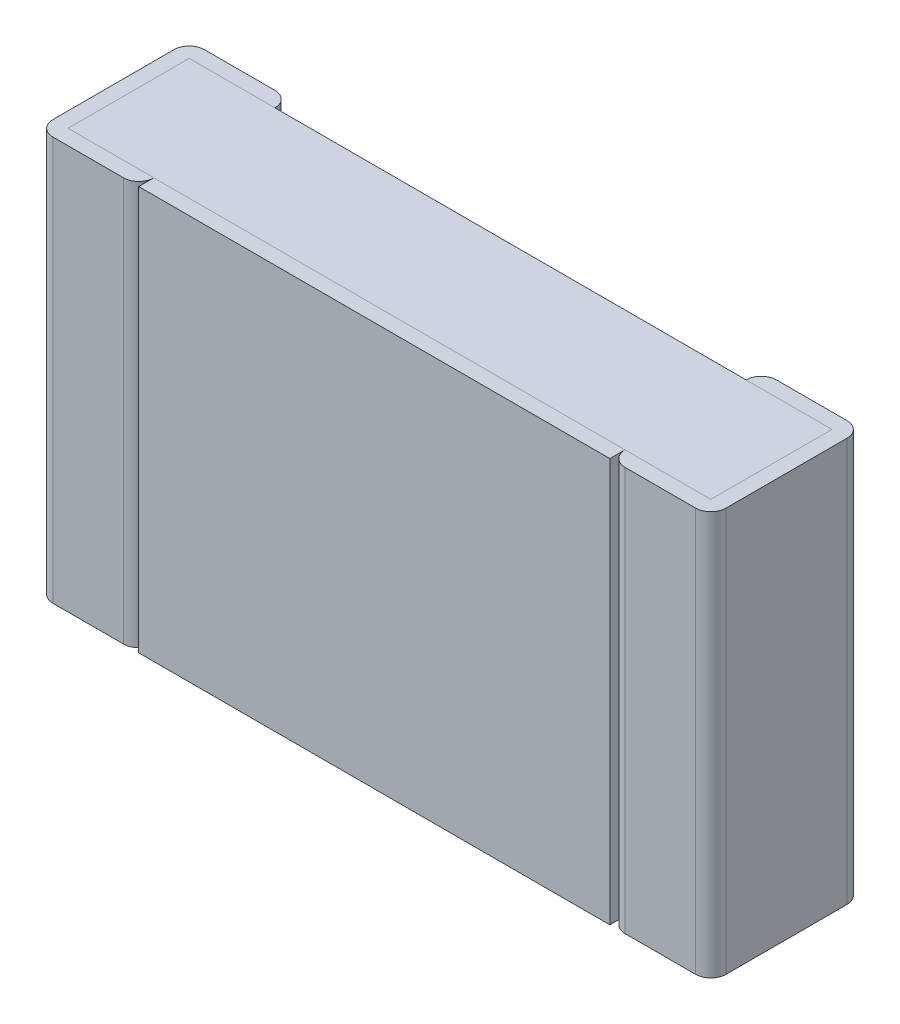
ISO-10303-21;
HEADER;
FILE_DESCRIPTION(('STEP AP214'),'2;1');
FILE_NAME('part.step','',(''),(''),'','','');
FILE_SCHEMA(('AUTOMOTIVE_DESIGN { 1 0 10303 214 1 1 1 1 }'));
ENDSEC;
DATA;
#1=APPLICATION_CONTEXT('core data for automotive mechanical design processes');
#2=APPLICATION_PROTOCOL_DEFINITION('international standard','automotive_design',2000,#1);
#3=PRODUCT_CONTEXT('',#1,'mechanical');
#4=PRODUCT('Part','Part','',(#3));
#5=PRODUCT_RELATED_PRODUCT_CATEGORY('part','',(#4));
#6=PRODUCT_DEFINITION_FORMATION('','',#4);
#7=PRODUCT_DEFINITION_CONTEXT('part definition',#1,'design');
#8=PRODUCT_DEFINITION('design','',#6,#7);
#9=PRODUCT_DEFINITION_SHAPE('','',#8);
#10=(LENGTH_UNIT() NAMED_UNIT(*) SI_UNIT(.MILLI.,.METRE.));
#11=(NAMED_UNIT(*) PLANE_ANGLE_UNIT() SI_UNIT($,.RADIAN.));
#12=(NAMED_UNIT(*) SI_UNIT($,.STERADIAN.) SOLID_ANGLE_UNIT());
#13=UNCERTAINTY_MEASURE_WITH_UNIT(LENGTH_MEASURE(1.E-05),#10,'distance_accuracy_value','');
#14=(GEOMETRIC_REPRESENTATION_CONTEXT(3) GLOBAL_UNCERTAINTY_ASSIGNED_CONTEXT((#13)) GLOBAL_UNIT_ASSIGNED_CONTEXT((#10,
#11,#12)) REPRESENTATION_CONTEXT('',''));
#15=CARTESIAN_POINT('',(0.,0.,0.));
#16=DIRECTION('',(0.,0.,1.));
#17=DIRECTION('',(1.,0.,0.));
#18=AXIS2_PLACEMENT_3D('',#15,#16,#17);
#19=CARTESIAN_POINT('',(-1.,-0.6,0.));
#20=DIRECTION('',(1.,0.,0.));
#21=DIRECTION('',(0.,1.,0.));
#22=AXIS2_PLACEMENT_3D('',#19,#20,#21);
#23=PLANE('',#22);
#24=DIRECTION('',(0.,1.,0.));
#25=VECTOR('',#24,1.);
#26=CARTESIAN_POINT('',(-1.,-0.6,0.405));
#27=LINE('',#26,#25);
#28=CARTESIAN_POINT('',(-1.,-0.6,0.405));
#29=VERTEX_POINT('',#28);
#30=CARTESIAN_POINT('',(-1.,0.6,0.405));
#31=VERTEX_POINT('',#30);
#32=EDGE_CURVE('E11',#29,#31,#27,.T.);
#33=ORIENTED_EDGE('',*,*,#32,.T.);
#34=DIRECTION('',(0.,0.,1.));
#35=VECTOR('',#34,1.);
#36=CARTESIAN_POINT('',(-1.,0.6,0.));
#37=LINE('',#36,#35);
#38=CARTESIAN_POINT('',(-1.,0.6,0.045));
#39=VERTEX_POINT('',#38);
#40=EDGE_CURVE('E41',#39,#31,#37,.T.);
#41=ORIENTED_EDGE('',*,*,#40,.F.);
#42=DIRECTION('',(0.,1.,0.));
#43=VECTOR('',#42,1.);
#44=CARTESIAN_POINT('',(-1.,-0.6,0.045));
#45=LINE('',#44,#43);
#46=CARTESIAN_POINT('',(-1.,-0.6,0.045));
#47=VERTEX_POINT('',#46);
#48=EDGE_CURVE('E317',#47,#39,#45,.T.);
#49=ORIENTED_EDGE('',*,*,#48,.F.);
#50=DIRECTION('',(0.,0.,1.));
#51=VECTOR('',#50,1.);
#52=CARTESIAN_POINT('',(-1.,-0.6,0.));
#53=LINE('',#52,#51);
#54=EDGE_CURVE('E27',#47,#29,#53,.T.);
#55=ORIENTED_EDGE('',*,*,#54,.T.);
#56=EDGE_LOOP('',(#33,#41,#49,#55));
#57=FACE_BOUND('',#56,.T.);
#58=ADVANCED_FACE('F16',(#57),#23,.F.);
#59=CARTESIAN_POINT('',(-1.,-0.6,0.));
#60=DIRECTION('',(0.,1.,0.));
#61=DIRECTION('',(1.,0.,0.));
#62=AXIS2_PLACEMENT_3D('',#59,#60,#61);
#63=PLANE('',#62);
#64=CARTESIAN_POINT('',(-0.745,-0.6,0.045));
#65=DIRECTION('',(0.,1.,0.));
#66=DIRECTION('',(0.,0.,1.));
#67=AXIS2_PLACEMENT_3D('',#64,#65,#66);
#68=CIRCLE('',#67,0.045);
#69=CARTESIAN_POINT('',(-0.7,-0.6,0.045));
#70=VERTEX_POINT('',#69);
#71=CARTESIAN_POINT('',(-0.745,-0.6,0.));
#72=VERTEX_POINT('',#71);
#73=EDGE_CURVE('E260',#70,#72,#68,.T.);
#74=ORIENTED_EDGE('',*,*,#73,.F.);
#75=DIRECTION('',(1.,0.,0.));
#76=VECTOR('',#75,1.);
#77=CARTESIAN_POINT('',(-0.955,-0.6,0.045));
#78=LINE('',#77,#76);
#79=CARTESIAN_POINT('',(-0.955,-0.6,0.045));
#80=VERTEX_POINT('',#79);
#81=EDGE_CURVE('E356',#80,#70,#78,.T.);
#82=ORIENTED_EDGE('',*,*,#81,.F.);
#83=DIRECTION('',(0.,0.,1.));
#84=VECTOR('',#83,1.);
#85=CARTESIAN_POINT('',(-0.955,-0.6,0.045));
#86=LINE('',#85,#84);
#87=CARTESIAN_POINT('',(-0.955,-0.6,0.405));
#88=VERTEX_POINT('',#87);
#89=EDGE_CURVE('E333',#80,#88,#86,.T.);
#90=ORIENTED_EDGE('',*,*,#89,.T.);
#91=DIRECTION('',(1.,0.,0.));
#92=VECTOR('',#91,1.);
#93=CARTESIAN_POINT('',(-0.955,-0.6,0.405));
#94=LINE('',#93,#92);
#95=CARTESIAN_POINT('',(-0.7,-0.6,0.405));
#96=VERTEX_POINT('',#95);
#97=EDGE_CURVE('E336',#88,#96,#94,.T.);
#98=ORIENTED_EDGE('',*,*,#97,.T.);
#99=CARTESIAN_POINT('',(-0.745,-0.6,0.405));
#100=DIRECTION('',(0.,-1.,0.));
#101=DIRECTION('',(0.,0.,1.));
#102=AXIS2_PLACEMENT_3D('',#99,#100,#101);
#103=CIRCLE('',#102,0.045);
#104=CARTESIAN_POINT('',(-0.745,-0.6,0.45));
#105=VERTEX_POINT('',#104);
#106=EDGE_CURVE('E344',#96,#105,#103,.T.);
#107=ORIENTED_EDGE('',*,*,#106,.T.);
#108=DIRECTION('',(1.,0.,0.));
#109=VECTOR('',#108,1.);
#110=CARTESIAN_POINT('',(-1.,-0.6,0.45));
#111=LINE('',#110,#109);
#112=CARTESIAN_POINT('',(-0.955,-0.6,0.45));
#113=VERTEX_POINT('',#112);
#114=EDGE_CURVE('E272',#113,#105,#111,.T.);
#115=ORIENTED_EDGE('',*,*,#114,.F.);
#116=CARTESIAN_POINT('',(-0.955,-0.6,0.405));
#117=DIRECTION('',(0.,1.,0.));
#118=DIRECTION('',(0.,0.,1.));
#119=AXIS2_PLACEMENT_3D('',#116,#117,#118);
#120=CIRCLE('',#119,0.045);
#121=EDGE_CURVE('E318',#29,#113,#120,.T.);
#122=ORIENTED_EDGE('',*,*,#121,.F.);
#123=ORIENTED_EDGE('',*,*,#54,.F.);
#124=CARTESIAN_POINT('',(-0.955,-0.6,0.045));
#125=DIRECTION('',(0.,-1.,0.));
#126=DIRECTION('',(0.,0.,1.));
#127=AXIS2_PLACEMENT_3D('',#124,#125,#126);
#128=CIRCLE('',#127,0.045);
#129=CARTESIAN_POINT('',(-0.955,-0.6,0.));
#130=VERTEX_POINT('',#129);
#131=EDGE_CURVE('E340',#47,#130,#128,.T.);
#132=ORIENTED_EDGE('',*,*,#131,.T.);
#133=DIRECTION('',(1.,0.,0.));
#134=VECTOR('',#133,1.);
#135=CARTESIAN_POINT('',(-1.,-0.6,0.));
#136=LINE('',#135,#134);
#137=EDGE_CURVE('E345',#130,#72,#136,.T.);
#138=ORIENTED_EDGE('',*,*,#137,.T.);
#139=EDGE_LOOP('',(#74,#82,#90,#98,#107,#115,#122,#123,#132,#138));
#140=FACE_BOUND('',#139,.T.);
#141=ADVANCED_FACE('F523',(#140),#63,.F.);
#142=CARTESIAN_POINT('',(-0.955,-0.6,0.045));
#143=DIRECTION('',(0.,1.,0.));
#144=DIRECTION('',(-1.,0.,0.));
#145=AXIS2_PLACEMENT_3D('',#142,#143,#144);
#146=CYLINDRICAL_SURFACE('',#145,0.045);
#147=ORIENTED_EDGE('',*,*,#48,.T.);
#148=CARTESIAN_POINT('',(-0.955,0.6,0.045));
#149=DIRECTION('',(0.,-1.,0.));
#150=DIRECTION('',(0.,0.,1.));
#151=AXIS2_PLACEMENT_3D('',#148,#149,#150);
#152=CIRCLE('',#151,0.045);
#153=CARTESIAN_POINT('',(-0.955,0.6,0.));
#154=VERTEX_POINT('',#153);
#155=EDGE_CURVE('E314',#39,#154,#152,.T.);
#156=ORIENTED_EDGE('',*,*,#155,.T.);
#157=DIRECTION('',(0.,1.,0.));
#158=VECTOR('',#157,1.);
#159=CARTESIAN_POINT('',(-0.955,-0.6,0.));
#160=LINE('',#159,#158);
#161=EDGE_CURVE('E311',#130,#154,#160,.T.);
#162=ORIENTED_EDGE('',*,*,#161,.F.);
#163=ORIENTED_EDGE('',*,*,#131,.F.);
#164=EDGE_LOOP('',(#147,#156,#162,#163));
#165=FACE_BOUND('',#164,.T.);
#166=ADVANCED_FACE('F552',(#165),#146,.T.);
#167=CARTESIAN_POINT('',(-0.955,-0.6,0.405));
#168=DIRECTION('',(0.,1.,0.));
#169=DIRECTION('',(-1.,0.,0.));
#170=AXIS2_PLACEMENT_3D('',#167,#168,#169);
#171=CYLINDRICAL_SURFACE('',#170,0.045);
#172=ORIENTED_EDGE('',*,*,#121,.T.);
#173=DIRECTION('',(0.,1.,0.));
#174=VECTOR('',#173,1.);
#175=CARTESIAN_POINT('',(-0.955,-0.6,0.45));
#176=LINE('',#175,#174);
#177=CARTESIAN_POINT('',(-0.955,0.6,0.45));
#178=VERTEX_POINT('',#177);
#179=EDGE_CURVE('E248',#113,#178,#176,.T.);
#180=ORIENTED_EDGE('',*,*,#179,.T.);
#181=CARTESIAN_POINT('',(-0.955,0.6,0.405));
#182=DIRECTION('',(0.,1.,0.));
#183=DIRECTION('',(0.,0.,1.));
#184=AXIS2_PLACEMENT_3D('',#181,#182,#183);
#185=CIRCLE('',#184,0.045);
#186=EDGE_CURVE('E267',#31,#178,#185,.T.);
#187=ORIENTED_EDGE('',*,*,#186,.F.);
#188=ORIENTED_EDGE('',*,*,#32,.F.);
#189=EDGE_LOOP('',(#172,#180,#187,#188));
#190=FACE_BOUND('',#189,.T.);
#191=ADVANCED_FACE('F548',(#190),#171,.T.);
#192=CARTESIAN_POINT('',(-1.,0.6,0.));
#193=DIRECTION('',(0.,1.,0.));
#194=DIRECTION('',(1.,0.,0.));
#195=AXIS2_PLACEMENT_3D('',#192,#193,#194);
#196=PLANE('',#195);
#197=DIRECTION('',(1.,0.,0.));
#198=VECTOR('',#197,1.);
#199=CARTESIAN_POINT('',(-1.,0.6,0.));
#200=LINE('',#199,#198);
#201=CARTESIAN_POINT('',(-0.745,0.6,0.));
#202=VERTEX_POINT('',#201);
#203=EDGE_CURVE('E263',#154,#202,#200,.T.);
#204=ORIENTED_EDGE('',*,*,#203,.F.);
#205=ORIENTED_EDGE('',*,*,#155,.F.);
#206=ORIENTED_EDGE('',*,*,#40,.T.);
#207=ORIENTED_EDGE('',*,*,#186,.T.);
#208=DIRECTION('',(1.,0.,0.));
#209=VECTOR('',#208,1.);
#210=CARTESIAN_POINT('',(-1.,0.6,0.45));
#211=LINE('',#210,#209);
#212=CARTESIAN_POINT('',(-0.745,0.6,0.45));
#213=VERTEX_POINT('',#212);
#214=EDGE_CURVE('E397',#178,#213,#211,.T.);
#215=ORIENTED_EDGE('',*,*,#214,.T.);
#216=CARTESIAN_POINT('',(-0.745,0.6,0.405));
#217=DIRECTION('',(0.,-1.,0.));
#218=DIRECTION('',(0.,0.,1.));
#219=AXIS2_PLACEMENT_3D('',#216,#217,#218);
#220=CIRCLE('',#219,0.045);
#221=CARTESIAN_POINT('',(-0.7,0.6,0.405));
#222=VERTEX_POINT('',#221);
#223=EDGE_CURVE('E291',#222,#213,#220,.T.);
#224=ORIENTED_EDGE('',*,*,#223,.F.);
#225=DIRECTION('',(1.,0.,0.));
#226=VECTOR('',#225,1.);
#227=CARTESIAN_POINT('',(-0.955,0.6,0.405));
#228=LINE('',#227,#226);
#229=CARTESIAN_POINT('',(-0.955,0.6,0.405));
#230=VERTEX_POINT('',#229);
#231=EDGE_CURVE('E368',#230,#222,#228,.T.);
#232=ORIENTED_EDGE('',*,*,#231,.F.);
#233=DIRECTION('',(0.,0.,1.));
#234=VECTOR('',#233,1.);
#235=CARTESIAN_POINT('',(-0.955,0.6,0.045));
#236=LINE('',#235,#234);
#237=CARTESIAN_POINT('',(-0.955,0.6,0.045));
#238=VERTEX_POINT('',#237);
#239=EDGE_CURVE('E294',#238,#230,#236,.T.);
#240=ORIENTED_EDGE('',*,*,#239,.F.);
#241=DIRECTION('',(1.,0.,0.));
#242=VECTOR('',#241,1.);
#243=CARTESIAN_POINT('',(-0.955,0.6,0.045));
#244=LINE('',#243,#242);
#245=CARTESIAN_POINT('',(-0.7,0.6,0.045));
#246=VERTEX_POINT('',#245);
#247=EDGE_CURVE('E310',#238,#246,#244,.T.);
#248=ORIENTED_EDGE('',*,*,#247,.T.);
#249=CARTESIAN_POINT('',(-0.745,0.6,0.045));
#250=DIRECTION('',(0.,1.,0.));
#251=DIRECTION('',(0.,0.,1.));
#252=AXIS2_PLACEMENT_3D('',#249,#250,#251);
#253=CIRCLE('',#252,0.045);
#254=EDGE_CURVE('E306',#246,#202,#253,.T.);
#255=ORIENTED_EDGE('',*,*,#254,.T.);
#256=EDGE_LOOP('',(#204,#205,#206,#207,#215,#224,#232,#240,#248,#255));
#257=FACE_BOUND('',#256,.T.);
#258=ADVANCED_FACE('F489',(#257),#196,.T.);
#259=CARTESIAN_POINT('',(-1.,-0.6,0.));
#260=DIRECTION('',(0.,0.,1.));
#261=DIRECTION('',(1.,0.,0.));
#262=AXIS2_PLACEMENT_3D('',#259,#260,#261);
#263=PLANE('',#262);
#264=DIRECTION('',(0.,1.,0.));
#265=VECTOR('',#264,1.);
#266=CARTESIAN_POINT('',(-0.745,-0.6,0.));
#267=LINE('',#266,#265);
#268=EDGE_CURVE('E264',#72,#202,#267,.T.);
#269=ORIENTED_EDGE('',*,*,#268,.F.);
#270=ORIENTED_EDGE('',*,*,#137,.F.);
#271=ORIENTED_EDGE('',*,*,#161,.T.);
#272=ORIENTED_EDGE('',*,*,#203,.T.);
#273=EDGE_LOOP('',(#269,#270,#271,#272));
#274=FACE_BOUND('',#273,.T.);
#275=ADVANCED_FACE('F678',(#274),#263,.F.);
#276=CARTESIAN_POINT('',(-0.745,-0.6,0.045));
#277=DIRECTION('',(0.,1.,0.));
#278=DIRECTION('',(1.,0.,0.));
#279=AXIS2_PLACEMENT_3D('',#276,#277,#278);
#280=CYLINDRICAL_SURFACE('',#279,0.045);
#281=ORIENTED_EDGE('',*,*,#73,.T.);
#282=ORIENTED_EDGE('',*,*,#268,.T.);
#283=ORIENTED_EDGE('',*,*,#254,.F.);
#284=DIRECTION('',(0.,1.,0.));
#285=VECTOR('',#284,1.);
#286=CARTESIAN_POINT('',(-0.7,-0.6,0.045));
#287=LINE('',#286,#285);
#288=EDGE_CURVE('E299',#70,#246,#287,.T.);
#289=ORIENTED_EDGE('',*,*,#288,.F.);
#290=EDGE_LOOP('',(#281,#282,#283,#289));
#291=FACE_BOUND('',#290,.T.);
#292=ADVANCED_FACE('F682',(#291),#280,.T.);
#293=CARTESIAN_POINT('',(-0.955,-0.6,0.045));
#294=DIRECTION('',(0.,1.,0.));
#295=DIRECTION('',(1.,0.,0.));
#296=AXIS2_PLACEMENT_3D('',#293,#294,#295);
#297=PLANE('',#296);
#298=DIRECTION('',(1.,0.,0.));
#299=VECTOR('',#298,1.);
#300=CARTESIAN_POINT('',(-0.955,-0.6,0.045));
#301=LINE('',#300,#299);
#302=CARTESIAN_POINT('',(0.7,-0.6,0.045));
#303=VERTEX_POINT('',#302);
#304=EDGE_CURVE('E346',#70,#303,#301,.T.);
#305=ORIENTED_EDGE('',*,*,#304,.T.);
#306=DIRECTION('',(1.,0.,0.));
#307=VECTOR('',#306,1.);
#308=CARTESIAN_POINT('',(-0.955,-0.6,0.045));
#309=LINE('',#308,#307);
#310=CARTESIAN_POINT('',(0.955,-0.6,0.045));
#311=VERTEX_POINT('',#310);
#312=EDGE_CURVE('E350',#303,#311,#309,.T.);
#313=ORIENTED_EDGE('',*,*,#312,.T.);
#314=DIRECTION('',(0.,0.,1.));
#315=VECTOR('',#314,1.);
#316=CARTESIAN_POINT('',(0.955,-0.6,0.045));
#317=LINE('',#316,#315);
#318=CARTESIAN_POINT('',(0.955,-0.6,0.405));
#319=VERTEX_POINT('',#318);
#320=EDGE_CURVE('E382',#311,#319,#317,.T.);
#321=ORIENTED_EDGE('',*,*,#320,.T.);
#322=DIRECTION('',(1.,0.,0.));
#323=VECTOR('',#322,1.);
#324=CARTESIAN_POINT('',(-0.955,-0.6,0.405));
#325=LINE('',#324,#323);
#326=CARTESIAN_POINT('',(0.7,-0.6,0.405));
#327=VERTEX_POINT('',#326);
#328=EDGE_CURVE('E421',#327,#319,#325,.T.);
#329=ORIENTED_EDGE('',*,*,#328,.F.);
#330=DIRECTION('',(1.,0.,0.));
#331=VECTOR('',#330,1.);
#332=CARTESIAN_POINT('',(-0.7,-0.6,0.405));
#333=LINE('',#332,#331);
#334=EDGE_CURVE('E301',#96,#327,#333,.T.);
#335=ORIENTED_EDGE('',*,*,#334,.F.);
#336=ORIENTED_EDGE('',*,*,#97,.F.);
#337=ORIENTED_EDGE('',*,*,#89,.F.);
#338=ORIENTED_EDGE('',*,*,#81,.T.);
#339=EDGE_LOOP('',(#305,#313,#321,#329,#335,#336,#337,#338));
#340=FACE_BOUND('',#339,.T.);
#341=ADVANCED_FACE('F483',(#340),#297,.F.);
#342=CARTESIAN_POINT('',(-1.,-0.6,0.45));
#343=DIRECTION('',(0.,0.,1.));
#344=DIRECTION('',(1.,0.,0.));
#345=AXIS2_PLACEMENT_3D('',#342,#343,#344);
#346=PLANE('',#345);
#347=ORIENTED_EDGE('',*,*,#214,.F.);
#348=ORIENTED_EDGE('',*,*,#179,.F.);
#349=ORIENTED_EDGE('',*,*,#114,.T.);
#350=DIRECTION('',(0.,1.,0.));
#351=VECTOR('',#350,1.);
#352=CARTESIAN_POINT('',(-0.745,-0.6,0.45));
#353=LINE('',#352,#351);
#354=EDGE_CURVE('E268',#105,#213,#353,.T.);
#355=ORIENTED_EDGE('',*,*,#354,.T.);
#356=EDGE_LOOP('',(#347,#348,#349,#355));
#357=FACE_BOUND('',#356,.T.);
#358=ADVANCED_FACE('F579',(#357),#346,.T.);
#359=CARTESIAN_POINT('',(-0.745,-0.6,0.405));
#360=DIRECTION('',(0.,1.,0.));
#361=DIRECTION('',(1.,0.,0.));
#362=AXIS2_PLACEMENT_3D('',#359,#360,#361);
#363=CYLINDRICAL_SURFACE('',#362,0.045);
#364=DIRECTION('',(0.,1.,0.));
#365=VECTOR('',#364,1.);
#366=CARTESIAN_POINT('',(-0.7,-0.6,0.405));
#367=LINE('',#366,#365);
#368=EDGE_CURVE('E273',#96,#222,#367,.T.);
#369=ORIENTED_EDGE('',*,*,#368,.T.);
#370=ORIENTED_EDGE('',*,*,#223,.T.);
#371=ORIENTED_EDGE('',*,*,#354,.F.);
#372=ORIENTED_EDGE('',*,*,#106,.F.);
#373=EDGE_LOOP('',(#369,#370,#371,#372));
#374=FACE_BOUND('',#373,.T.);
#375=ADVANCED_FACE('F575',(#374),#363,.T.);
#376=CARTESIAN_POINT('',(-0.955,0.6,0.045));
#377=DIRECTION('',(0.,1.,0.));
#378=DIRECTION('',(1.,0.,0.));
#379=AXIS2_PLACEMENT_3D('',#376,#377,#378);
#380=PLANE('',#379);
#381=ORIENTED_EDGE('',*,*,#247,.F.);
#382=ORIENTED_EDGE('',*,*,#239,.T.);
#383=ORIENTED_EDGE('',*,*,#231,.T.);
#384=DIRECTION('',(1.,0.,0.));
#385=VECTOR('',#384,1.);
#386=CARTESIAN_POINT('',(-0.7,0.6,0.405));
#387=LINE('',#386,#385);
#388=CARTESIAN_POINT('',(0.7,0.6,0.405));
#389=VERTEX_POINT('',#388);
#390=EDGE_CURVE('E322',#222,#389,#387,.T.);
#391=ORIENTED_EDGE('',*,*,#390,.T.);
#392=DIRECTION('',(1.,0.,0.));
#393=VECTOR('',#392,1.);
#394=CARTESIAN_POINT('',(-0.955,0.6,0.405));
#395=LINE('',#394,#393);
#396=CARTESIAN_POINT('',(0.955,0.6,0.405));
#397=VERTEX_POINT('',#396);
#398=EDGE_CURVE('E228',#389,#397,#395,.T.);
#399=ORIENTED_EDGE('',*,*,#398,.T.);
#400=DIRECTION('',(0.,0.,1.));
#401=VECTOR('',#400,1.);
#402=CARTESIAN_POINT('',(0.955,0.6,0.045));
#403=LINE('',#402,#401);
#404=CARTESIAN_POINT('',(0.955,0.6,0.045));
#405=VERTEX_POINT('',#404);
#406=EDGE_CURVE('E219',#405,#397,#403,.T.);
#407=ORIENTED_EDGE('',*,*,#406,.F.);
#408=DIRECTION('',(1.,0.,0.));
#409=VECTOR('',#408,1.);
#410=CARTESIAN_POINT('',(-0.955,0.6,0.045));
#411=LINE('',#410,#409);
#412=CARTESIAN_POINT('',(0.7,0.6,0.045));
#413=VERTEX_POINT('',#412);
#414=EDGE_CURVE('E224',#413,#405,#411,.T.);
#415=ORIENTED_EDGE('',*,*,#414,.F.);
#416=DIRECTION('',(1.,0.,0.));
#417=VECTOR('',#416,1.);
#418=CARTESIAN_POINT('',(-0.955,0.6,0.045));
#419=LINE('',#418,#417);
#420=EDGE_CURVE('E323',#246,#413,#419,.T.);
#421=ORIENTED_EDGE('',*,*,#420,.F.);
#422=EDGE_LOOP('',(#381,#382,#383,#391,#399,#407,#415,#421));
#423=FACE_BOUND('',#422,.T.);
#424=ADVANCED_FACE('F222',(#423),#380,.T.);
#425=CARTESIAN_POINT('',(-0.955,-0.6,0.045));
#426=DIRECTION('',(0.,0.,1.));
#427=DIRECTION('',(1.,0.,0.));
#428=AXIS2_PLACEMENT_3D('',#425,#426,#427);
#429=PLANE('',#428);
#430=ORIENTED_EDGE('',*,*,#420,.T.);
#431=DIRECTION('',(0.,1.,0.));
#432=VECTOR('',#431,1.);
#433=CARTESIAN_POINT('',(0.7,-0.6,0.045));
#434=LINE('',#433,#432);
#435=EDGE_CURVE('E282',#303,#413,#434,.T.);
#436=ORIENTED_EDGE('',*,*,#435,.F.);
#437=ORIENTED_EDGE('',*,*,#304,.F.);
#438=ORIENTED_EDGE('',*,*,#288,.T.);
#439=EDGE_LOOP('',(#430,#436,#437,#438));
#440=FACE_BOUND('',#439,.T.);
#441=ADVANCED_FACE('F486',(#440),#429,.F.);
#442=CARTESIAN_POINT('',(0.7,-0.6,0.));
#443=DIRECTION('',(0.,1.,0.));
#444=DIRECTION('',(1.,0.,0.));
#445=AXIS2_PLACEMENT_3D('',#442,#443,#444);
#446=PLANE('',#445);
#447=CARTESIAN_POINT('',(0.955,-0.6,0.045));
#448=DIRECTION('',(0.,1.,0.));
#449=DIRECTION('',(0.,0.,1.));
#450=AXIS2_PLACEMENT_3D('',#447,#448,#449);
#451=CIRCLE('',#450,0.045);
#452=CARTESIAN_POINT('',(1.,-0.6,0.045));
#453=VERTEX_POINT('',#452);
#454=CARTESIAN_POINT('',(0.955,-0.6,0.));
#455=VERTEX_POINT('',#454);
#456=EDGE_CURVE('E283',#453,#455,#451,.T.);
#457=ORIENTED_EDGE('',*,*,#456,.F.);
#458=DIRECTION('',(0.,0.,1.));
#459=VECTOR('',#458,1.);
#460=CARTESIAN_POINT('',(1.,-0.6,0.));
#461=LINE('',#460,#459);
#462=CARTESIAN_POINT('',(1.,-0.6,0.405));
#463=VERTEX_POINT('',#462);
#464=EDGE_CURVE('E295',#453,#463,#461,.T.);
#465=ORIENTED_EDGE('',*,*,#464,.T.);
#466=CARTESIAN_POINT('',(0.955,-0.6,0.405));
#467=DIRECTION('',(0.,-1.,0.));
#468=DIRECTION('',(0.,0.,1.));
#469=AXIS2_PLACEMENT_3D('',#466,#467,#468);
#470=CIRCLE('',#469,0.045);
#471=CARTESIAN_POINT('',(0.955,-0.6,0.45));
#472=VERTEX_POINT('',#471);
#473=EDGE_CURVE('E300',#463,#472,#470,.T.);
#474=ORIENTED_EDGE('',*,*,#473,.T.);
#475=DIRECTION('',(1.,0.,0.));
#476=VECTOR('',#475,1.);
#477=CARTESIAN_POINT('',(0.7,-0.6,0.45));
#478=LINE('',#477,#476);
#479=CARTESIAN_POINT('',(0.745,-0.6,0.45));
#480=VERTEX_POINT('',#479);
#481=EDGE_CURVE('E259',#480,#472,#478,.T.);
#482=ORIENTED_EDGE('',*,*,#481,.F.);
#483=CARTESIAN_POINT('',(0.745,-0.6,0.405));
#484=DIRECTION('',(0.,1.,0.));
#485=DIRECTION('',(0.,0.,1.));
#486=AXIS2_PLACEMENT_3D('',#483,#484,#485);
#487=CIRCLE('',#486,0.045);
#488=EDGE_CURVE('E364',#327,#480,#487,.T.);
#489=ORIENTED_EDGE('',*,*,#488,.F.);
#490=ORIENTED_EDGE('',*,*,#328,.T.);
#491=ORIENTED_EDGE('',*,*,#320,.F.);
#492=ORIENTED_EDGE('',*,*,#312,.F.);
#493=CARTESIAN_POINT('',(0.745,-0.6,0.045));
#494=DIRECTION('',(0.,-1.,0.));
#495=DIRECTION('',(0.,0.,1.));
#496=AXIS2_PLACEMENT_3D('',#493,#494,#495);
#497=CIRCLE('',#496,0.045);
#498=CARTESIAN_POINT('',(0.745,-0.6,0.));
#499=VERTEX_POINT('',#498);
#500=EDGE_CURVE('E433',#303,#499,#497,.T.);
#501=ORIENTED_EDGE('',*,*,#500,.T.);
#502=DIRECTION('',(1.,0.,0.));
#503=VECTOR('',#502,1.);
#504=CARTESIAN_POINT('',(0.7,-0.6,0.));
#505=LINE('',#504,#503);
#506=EDGE_CURVE('E326',#499,#455,#505,.T.);
#507=ORIENTED_EDGE('',*,*,#506,.T.);
#508=EDGE_LOOP('',(#457,#465,#474,#482,#489,#490,#491,#492,#501,#507));
#509=FACE_BOUND('',#508,.T.);
#510=ADVANCED_FACE('F479',(#509),#446,.F.);
#511=CARTESIAN_POINT('',(-0.7,-0.6,0.405));
#512=DIRECTION('',(0.,1.,0.));
#513=DIRECTION('',(1.,0.,0.));
#514=AXIS2_PLACEMENT_3D('',#511,#512,#513);
#515=PLANE('',#514);
#516=DIRECTION('',(0.,0.,1.));
#517=VECTOR('',#516,1.);
#518=CARTESIAN_POINT('',(0.7,-0.6,0.405));
#519=LINE('',#518,#517);
#520=CARTESIAN_POINT('',(0.7,-0.6,0.45));
#521=VERTEX_POINT('',#520);
#522=EDGE_CURVE('E305',#327,#521,#519,.T.);
#523=ORIENTED_EDGE('',*,*,#522,.T.);
#524=DIRECTION('',(1.,0.,0.));
#525=VECTOR('',#524,1.);
#526=CARTESIAN_POINT('',(-0.7,-0.6,0.45));
#527=LINE('',#526,#525);
#528=CARTESIAN_POINT('',(-0.7,-0.6,0.45));
#529=VERTEX_POINT('',#528);
#530=EDGE_CURVE('E180',#529,#521,#527,.T.);
#531=ORIENTED_EDGE('',*,*,#530,.F.);
#532=DIRECTION('',(0.,0.,1.));
#533=VECTOR('',#532,1.);
#534=CARTESIAN_POINT('',(-0.7,-0.6,0.405));
#535=LINE('',#534,#533);
#536=EDGE_CURVE('E238',#96,#529,#535,.T.);
#537=ORIENTED_EDGE('',*,*,#536,.F.);
#538=ORIENTED_EDGE('',*,*,#334,.T.);
#539=EDGE_LOOP('',(#523,#531,#537,#538));
#540=FACE_BOUND('',#539,.T.);
#541=ADVANCED_FACE('F18',(#540),#515,.F.);
#542=CARTESIAN_POINT('',(-0.7,-0.6,0.405));
#543=DIRECTION('',(1.,0.,0.));
#544=DIRECTION('',(0.,1.,0.));
#545=AXIS2_PLACEMENT_3D('',#542,#543,#544);
#546=PLANE('',#545);
#547=DIRECTION('',(0.,1.,0.));
#548=VECTOR('',#547,1.);
#549=CARTESIAN_POINT('',(-0.7,-0.6,0.45));
#550=LINE('',#549,#548);
#551=CARTESIAN_POINT('',(-0.7,0.6,0.45));
#552=VERTEX_POINT('',#551);
#553=EDGE_CURVE('E244',#529,#552,#550,.T.);
#554=ORIENTED_EDGE('',*,*,#553,.T.);
#555=DIRECTION('',(0.,0.,1.));
#556=VECTOR('',#555,1.);
#557=CARTESIAN_POINT('',(-0.7,0.6,0.405));
#558=LINE('',#557,#556);
#559=EDGE_CURVE('E20',#222,#552,#558,.T.);
#560=ORIENTED_EDGE('',*,*,#559,.F.);
#561=ORIENTED_EDGE('',*,*,#368,.F.);
#562=ORIENTED_EDGE('',*,*,#536,.T.);
#563=EDGE_LOOP('',(#554,#560,#561,#562));
#564=FACE_BOUND('',#563,.T.);
#565=ADVANCED_FACE('F528',(#564),#546,.F.);
#566=CARTESIAN_POINT('',(0.7,0.6,0.));
#567=DIRECTION('',(0.,1.,0.));
#568=DIRECTION('',(1.,0.,0.));
#569=AXIS2_PLACEMENT_3D('',#566,#567,#568);
#570=PLANE('',#569);
#571=DIRECTION('',(1.,0.,0.));
#572=VECTOR('',#571,1.);
#573=CARTESIAN_POINT('',(0.7,0.6,0.));
#574=LINE('',#573,#572);
#575=CARTESIAN_POINT('',(0.745,0.6,0.));
#576=VERTEX_POINT('',#575);
#577=CARTESIAN_POINT('',(0.955,0.6,0.));
#578=VERTEX_POINT('',#577);
#579=EDGE_CURVE('E286',#576,#578,#574,.T.);
#580=ORIENTED_EDGE('',*,*,#579,.F.);
#581=CARTESIAN_POINT('',(0.745,0.6,0.045));
#582=DIRECTION('',(0.,-1.,0.));
#583=DIRECTION('',(0.,0.,1.));
#584=AXIS2_PLACEMENT_3D('',#581,#582,#583);
#585=CIRCLE('',#584,0.045);
#586=EDGE_CURVE('E236',#413,#576,#585,.T.);
#587=ORIENTED_EDGE('',*,*,#586,.F.);
#588=ORIENTED_EDGE('',*,*,#414,.T.);
#589=ORIENTED_EDGE('',*,*,#406,.T.);
#590=ORIENTED_EDGE('',*,*,#398,.F.);
#591=CARTESIAN_POINT('',(0.745,0.6,0.405));
#592=DIRECTION('',(0.,1.,0.));
#593=DIRECTION('',(0.,0.,1.));
#594=AXIS2_PLACEMENT_3D('',#591,#592,#593);
#595=CIRCLE('',#594,0.045);
#596=CARTESIAN_POINT('',(0.745,0.6,0.45));
#597=VERTEX_POINT('',#596);
#598=EDGE_CURVE('E231',#389,#597,#595,.T.);
#599=ORIENTED_EDGE('',*,*,#598,.T.);
#600=DIRECTION('',(1.,0.,0.));
#601=VECTOR('',#600,1.);
#602=CARTESIAN_POINT('',(0.7,0.6,0.45));
#603=LINE('',#602,#601);
#604=CARTESIAN_POINT('',(0.955,0.6,0.45));
#605=VERTEX_POINT('',#604);
#606=EDGE_CURVE('E250',#597,#605,#603,.T.);
#607=ORIENTED_EDGE('',*,*,#606,.T.);
#608=CARTESIAN_POINT('',(0.955,0.6,0.405));
#609=DIRECTION('',(0.,-1.,0.));
#610=DIRECTION('',(0.,0.,1.));
#611=AXIS2_PLACEMENT_3D('',#608,#609,#610);
#612=CIRCLE('',#611,0.045);
#613=CARTESIAN_POINT('',(1.,0.6,0.405));
#614=VERTEX_POINT('',#613);
#615=EDGE_CURVE('E254',#614,#605,#612,.T.);
#616=ORIENTED_EDGE('',*,*,#615,.F.);
#617=DIRECTION('',(0.,0.,1.));
#618=VECTOR('',#617,1.);
#619=CARTESIAN_POINT('',(1.,0.6,0.));
#620=LINE('',#619,#618);
#621=CARTESIAN_POINT('',(1.,0.6,0.045));
#622=VERTEX_POINT('',#621);
#623=EDGE_CURVE('E363',#622,#614,#620,.T.);
#624=ORIENTED_EDGE('',*,*,#623,.F.);
#625=CARTESIAN_POINT('',(0.955,0.6,0.045));
#626=DIRECTION('',(0.,1.,0.));
#627=DIRECTION('',(0.,0.,1.));
#628=AXIS2_PLACEMENT_3D('',#625,#626,#627);
#629=CIRCLE('',#628,0.045);
#630=EDGE_CURVE('E253',#622,#578,#629,.T.);
#631=ORIENTED_EDGE('',*,*,#630,.T.);
#632=EDGE_LOOP('',(#580,#587,#588,#589,#590,#599,#607,#616,#624,#631));
#633=FACE_BOUND('',#632,.T.);
#634=ADVANCED_FACE('F234',(#633),#570,.T.);
#635=CARTESIAN_POINT('',(-0.7,0.6,0.405));
#636=DIRECTION('',(0.,1.,0.));
#637=DIRECTION('',(1.,0.,0.));
#638=AXIS2_PLACEMENT_3D('',#635,#636,#637);
#639=PLANE('',#638);
#640=ORIENTED_EDGE('',*,*,#390,.F.);
#641=ORIENTED_EDGE('',*,*,#559,.T.);
#642=DIRECTION('',(1.,0.,0.));
#643=VECTOR('',#642,1.);
#644=CARTESIAN_POINT('',(-0.7,0.6,0.45));
#645=LINE('',#644,#643);
#646=CARTESIAN_POINT('',(0.7,0.6,0.45));
#647=VERTEX_POINT('',#646);
#648=EDGE_CURVE('E278',#552,#647,#645,.T.);
#649=ORIENTED_EDGE('',*,*,#648,.T.);
#650=DIRECTION('',(0.,0.,1.));
#651=VECTOR('',#650,1.);
#652=CARTESIAN_POINT('',(0.7,0.6,0.405));
#653=LINE('',#652,#651);
#654=EDGE_CURVE('E274',#389,#647,#653,.T.);
#655=ORIENTED_EDGE('',*,*,#654,.F.);
#656=EDGE_LOOP('',(#640,#641,#649,#655));
#657=FACE_BOUND('',#656,.T.);
#658=ADVANCED_FACE('F532',(#657),#639,.T.);
#659=CARTESIAN_POINT('',(0.745,-0.6,0.045));
#660=DIRECTION('',(0.,1.,0.));
#661=DIRECTION('',(-1.,0.,0.));
#662=AXIS2_PLACEMENT_3D('',#659,#660,#661);
#663=CYLINDRICAL_SURFACE('',#662,0.045);
#664=ORIENTED_EDGE('',*,*,#435,.T.);
#665=ORIENTED_EDGE('',*,*,#586,.T.);
#666=DIRECTION('',(0.,1.,0.));
#667=VECTOR('',#666,1.);
#668=CARTESIAN_POINT('',(0.745,-0.6,0.));
#669=LINE('',#668,#667);
#670=EDGE_CURVE('E374',#499,#576,#669,.T.);
#671=ORIENTED_EDGE('',*,*,#670,.F.);
#672=ORIENTED_EDGE('',*,*,#500,.F.);
#673=EDGE_LOOP('',(#664,#665,#671,#672));
#674=FACE_BOUND('',#673,.T.);
#675=ADVANCED_FACE('F471',(#674),#663,.T.);
#676=CARTESIAN_POINT('',(0.7,-0.6,0.));
#677=DIRECTION('',(0.,0.,1.));
#678=DIRECTION('',(1.,0.,0.));
#679=AXIS2_PLACEMENT_3D('',#676,#677,#678);
#680=PLANE('',#679);
#681=DIRECTION('',(0.,1.,0.));
#682=VECTOR('',#681,1.);
#683=CARTESIAN_POINT('',(0.955,-0.6,0.));
#684=LINE('',#683,#682);
#685=EDGE_CURVE('E287',#455,#578,#684,.T.);
#686=ORIENTED_EDGE('',*,*,#685,.F.);
#687=ORIENTED_EDGE('',*,*,#506,.F.);
#688=ORIENTED_EDGE('',*,*,#670,.T.);
#689=ORIENTED_EDGE('',*,*,#579,.T.);
#690=EDGE_LOOP('',(#686,#687,#688,#689));
#691=FACE_BOUND('',#690,.T.);
#692=ADVANCED_FACE('F475',(#691),#680,.F.);
#693=CARTESIAN_POINT('',(0.955,-0.6,0.045));
#694=DIRECTION('',(0.,1.,0.));
#695=DIRECTION('',(1.,0.,0.));
#696=AXIS2_PLACEMENT_3D('',#693,#694,#695);
#697=CYLINDRICAL_SURFACE('',#696,0.045);
#698=ORIENTED_EDGE('',*,*,#456,.T.);
#699=ORIENTED_EDGE('',*,*,#685,.T.);
#700=ORIENTED_EDGE('',*,*,#630,.F.);
#701=DIRECTION('',(0.,1.,0.));
#702=VECTOR('',#701,1.);
#703=CARTESIAN_POINT('',(1.,-0.6,0.045));
#704=LINE('',#703,#702);
#705=EDGE_CURVE('E400',#453,#622,#704,.T.);
#706=ORIENTED_EDGE('',*,*,#705,.F.);
#707=EDGE_LOOP('',(#698,#699,#700,#706));
#708=FACE_BOUND('',#707,.T.);
#709=ADVANCED_FACE('F515',(#708),#697,.T.);
#710=CARTESIAN_POINT('',(1.,-0.6,0.));
#711=DIRECTION('',(1.,0.,0.));
#712=DIRECTION('',(0.,1.,0.));
#713=AXIS2_PLACEMENT_3D('',#710,#711,#712);
#714=PLANE('',#713);
#715=ORIENTED_EDGE('',*,*,#464,.F.);
#716=ORIENTED_EDGE('',*,*,#705,.T.);
#717=ORIENTED_EDGE('',*,*,#623,.T.);
#718=DIRECTION('',(0.,1.,0.));
#719=VECTOR('',#718,1.);
#720=CARTESIAN_POINT('',(1.,-0.6,0.405));
#721=LINE('',#720,#719);
#722=EDGE_CURVE('E258',#463,#614,#721,.T.);
#723=ORIENTED_EDGE('',*,*,#722,.F.);
#724=EDGE_LOOP('',(#715,#716,#717,#723));
#725=FACE_BOUND('',#724,.T.);
#726=ADVANCED_FACE('F511',(#725),#714,.T.);
#727=CARTESIAN_POINT('',(0.955,-0.6,0.405));
#728=DIRECTION('',(0.,1.,0.));
#729=DIRECTION('',(1.,0.,0.));
#730=AXIS2_PLACEMENT_3D('',#727,#728,#729);
#731=CYLINDRICAL_SURFACE('',#730,0.045);
#732=ORIENTED_EDGE('',*,*,#722,.T.);
#733=ORIENTED_EDGE('',*,*,#615,.T.);
#734=DIRECTION('',(0.,1.,0.));
#735=VECTOR('',#734,1.);
#736=CARTESIAN_POINT('',(0.955,-0.6,0.45));
#737=LINE('',#736,#735);
#738=EDGE_CURVE('E367',#472,#605,#737,.T.);
#739=ORIENTED_EDGE('',*,*,#738,.F.);
#740=ORIENTED_EDGE('',*,*,#473,.F.);
#741=EDGE_LOOP('',(#732,#733,#739,#740));
#742=FACE_BOUND('',#741,.T.);
#743=ADVANCED_FACE('F507',(#742),#731,.T.);
#744=CARTESIAN_POINT('',(0.7,-0.6,0.45));
#745=DIRECTION('',(0.,0.,1.));
#746=DIRECTION('',(1.,0.,0.));
#747=AXIS2_PLACEMENT_3D('',#744,#745,#746);
#748=PLANE('',#747);
#749=ORIENTED_EDGE('',*,*,#606,.F.);
#750=DIRECTION('',(0.,1.,0.));
#751=VECTOR('',#750,1.);
#752=CARTESIAN_POINT('',(0.745,-0.6,0.45));
#753=LINE('',#752,#751);
#754=EDGE_CURVE('E330',#480,#597,#753,.T.);
#755=ORIENTED_EDGE('',*,*,#754,.F.);
#756=ORIENTED_EDGE('',*,*,#481,.T.);
#757=ORIENTED_EDGE('',*,*,#738,.T.);
#758=EDGE_LOOP('',(#749,#755,#756,#757));
#759=FACE_BOUND('',#758,.T.);
#760=ADVANCED_FACE('F505',(#759),#748,.T.);
#761=CARTESIAN_POINT('',(0.745,-0.6,0.405));
#762=DIRECTION('',(0.,1.,0.));
#763=DIRECTION('',(-1.,0.,0.));
#764=AXIS2_PLACEMENT_3D('',#761,#762,#763);
#765=CYLINDRICAL_SURFACE('',#764,0.045);
#766=ORIENTED_EDGE('',*,*,#488,.T.);
#767=ORIENTED_EDGE('',*,*,#754,.T.);
#768=ORIENTED_EDGE('',*,*,#598,.F.);
#769=DIRECTION('',(0.,1.,0.));
#770=VECTOR('',#769,1.);
#771=CARTESIAN_POINT('',(0.7,-0.6,0.405));
#772=LINE('',#771,#770);
#773=EDGE_CURVE('E277',#327,#389,#772,.T.);
#774=ORIENTED_EDGE('',*,*,#773,.F.);
#775=EDGE_LOOP('',(#766,#767,#768,#774));
#776=FACE_BOUND('',#775,.T.);
#777=ADVANCED_FACE('F500',(#776),#765,.T.);
#778=CARTESIAN_POINT('',(0.7,-0.6,0.405));
#779=DIRECTION('',(1.,0.,0.));
#780=DIRECTION('',(0.,1.,0.));
#781=AXIS2_PLACEMENT_3D('',#778,#779,#780);
#782=PLANE('',#781);
#783=ORIENTED_EDGE('',*,*,#522,.F.);
#784=ORIENTED_EDGE('',*,*,#773,.T.);
#785=ORIENTED_EDGE('',*,*,#654,.T.);
#786=DIRECTION('',(0.,1.,0.));
#787=VECTOR('',#786,1.);
#788=CARTESIAN_POINT('',(0.7,-0.6,0.45));
#789=LINE('',#788,#787);
#790=EDGE_CURVE('E388',#521,#647,#789,.T.);
#791=ORIENTED_EDGE('',*,*,#790,.F.);
#792=EDGE_LOOP('',(#783,#784,#785,#791));
#793=FACE_BOUND('',#792,.T.);
#794=ADVANCED_FACE('F495',(#793),#782,.T.);
#795=CARTESIAN_POINT('',(-0.7,-0.6,0.45));
#796=DIRECTION('',(0.,0.,1.));
#797=DIRECTION('',(1.,0.,0.));
#798=AXIS2_PLACEMENT_3D('',#795,#796,#797);
#799=PLANE('',#798);
#800=ORIENTED_EDGE('',*,*,#553,.F.);
#801=ORIENTED_EDGE('',*,*,#530,.T.);
#802=ORIENTED_EDGE('',*,*,#790,.T.);
#803=ORIENTED_EDGE('',*,*,#648,.F.);
#804=EDGE_LOOP('',(#800,#801,#802,#803));
#805=FACE_BOUND('',#804,.T.);
#806=ADVANCED_FACE('F531',(#805),#799,.T.);
#807=CLOSED_SHELL('',(#58,#141,#166,#191,#258,#275,#292,#341,#358,#375,#424,#441,#510,#541,#565,
#634,#658,#675,#692,#709,#726,#743,#760,#777,#794,#806));
#808=MANIFOLD_SOLID_BREP('B1',#807);
#809=ADVANCED_BREP_SHAPE_REPRESENTATION('',(#18,#808),#14);
#810=SHAPE_DEFINITION_REPRESENTATION(#9,#809);
ENDSEC;
END-ISO-10303-21;
